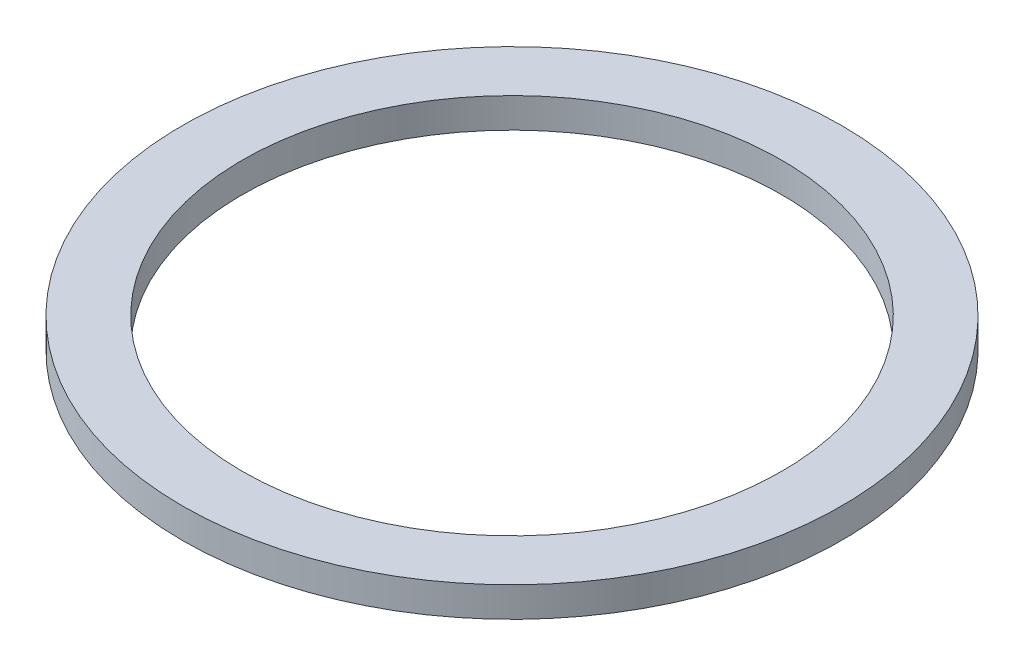
ISO-10303-21;
HEADER;
FILE_DESCRIPTION(('STEP AP214'),'2;1');
FILE_NAME('part.step','',(''),(''),'','','');
FILE_SCHEMA(('AUTOMOTIVE_DESIGN { 1 0 10303 214 1 1 1 1 }'));
ENDSEC;
DATA;
#1=APPLICATION_CONTEXT('core data for automotive mechanical design processes');
#2=APPLICATION_PROTOCOL_DEFINITION('international standard','automotive_design',2000,#1);
#3=PRODUCT_CONTEXT('',#1,'mechanical');
#4=PRODUCT('Part','Part','',(#3));
#5=PRODUCT_RELATED_PRODUCT_CATEGORY('part','',(#4));
#6=PRODUCT_DEFINITION_FORMATION('','',#4);
#7=PRODUCT_DEFINITION_CONTEXT('part definition',#1,'design');
#8=PRODUCT_DEFINITION('design','',#6,#7);
#9=PRODUCT_DEFINITION_SHAPE('','',#8);
#10=(LENGTH_UNIT() NAMED_UNIT(*) SI_UNIT(.MILLI.,.METRE.));
#11=(NAMED_UNIT(*) PLANE_ANGLE_UNIT() SI_UNIT($,.RADIAN.));
#12=(NAMED_UNIT(*) SI_UNIT($,.STERADIAN.) SOLID_ANGLE_UNIT());
#13=UNCERTAINTY_MEASURE_WITH_UNIT(LENGTH_MEASURE(1.E-05),#10,'distance_accuracy_value','');
#14=(GEOMETRIC_REPRESENTATION_CONTEXT(3) GLOBAL_UNCERTAINTY_ASSIGNED_CONTEXT((#13)) GLOBAL_UNIT_ASSIGNED_CONTEXT((#10,
#11,#12)) REPRESENTATION_CONTEXT('',''));
#15=CARTESIAN_POINT('',(0.,0.,0.));
#16=DIRECTION('',(0.,0.,1.));
#17=DIRECTION('',(1.,0.,0.));
#18=AXIS2_PLACEMENT_3D('',#15,#16,#17);
#19=CARTESIAN_POINT('',(0.,5.,0.));
#20=DIRECTION('',(0.,-1.,0.));
#21=DIRECTION('',(0.,0.,-1.));
#22=AXIS2_PLACEMENT_3D('',#19,#20,#21);
#23=CYLINDRICAL_SURFACE('',#22,55.);
#24=CARTESIAN_POINT('',(0.,5.,0.));
#25=DIRECTION('',(0.,1.,0.));
#26=DIRECTION('',(0.,0.,1.));
#27=AXIS2_PLACEMENT_3D('',#24,#25,#26);
#28=CIRCLE('',#27,55.);
#29=CARTESIAN_POINT('',(0.,5.,55.));
#30=VERTEX_POINT('',#29);
#31=EDGE_CURVE('E10',#30,#30,#28,.T.);
#32=ORIENTED_EDGE('',*,*,#31,.F.);
#33=EDGE_LOOP('',(#32));
#34=FACE_BOUND('',#33,.T.);
#35=CARTESIAN_POINT('',(0.,0.,0.));
#36=DIRECTION('',(0.,1.,0.));
#37=DIRECTION('',(0.,0.,1.));
#38=AXIS2_PLACEMENT_3D('',#35,#36,#37);
#39=CIRCLE('',#38,55.);
#40=CARTESIAN_POINT('',(0.,0.,55.));
#41=VERTEX_POINT('',#40);
#42=EDGE_CURVE('E37',#41,#41,#39,.T.);
#43=ORIENTED_EDGE('',*,*,#42,.T.);
#44=EDGE_LOOP('',(#43));
#45=FACE_BOUND('',#44,.T.);
#46=ADVANCED_FACE('F40',(#34,#45),#23,.T.);
#47=CARTESIAN_POINT('',(0.,5.,0.));
#48=DIRECTION('',(0.,1.,0.));
#49=DIRECTION('',(0.,0.,1.));
#50=AXIS2_PLACEMENT_3D('',#47,#48,#49);
#51=PLANE('',#50);
#52=CARTESIAN_POINT('',(0.,5.,0.));
#53=DIRECTION('',(0.,1.,0.));
#54=DIRECTION('',(0.,0.,1.));
#55=AXIS2_PLACEMENT_3D('',#52,#53,#54);
#56=CIRCLE('',#55,45.);
#57=CARTESIAN_POINT('',(0.,5.,45.));
#58=VERTEX_POINT('',#57);
#59=EDGE_CURVE('E50',#58,#58,#56,.T.);
#60=ORIENTED_EDGE('',*,*,#59,.F.);
#61=EDGE_LOOP('',(#60));
#62=FACE_BOUND('',#61,.T.);
#63=ORIENTED_EDGE('',*,*,#31,.T.);
#64=EDGE_LOOP('',(#63));
#65=FACE_BOUND('',#64,.T.);
#66=ADVANCED_FACE('F59',(#62,#65),#51,.T.);
#67=CARTESIAN_POINT('',(0.,0.,0.));
#68=DIRECTION('',(0.,1.,0.));
#69=DIRECTION('',(0.,0.,1.));
#70=AXIS2_PLACEMENT_3D('',#67,#68,#69);
#71=PLANE('',#70);
#72=CARTESIAN_POINT('',(0.,0.,0.));
#73=DIRECTION('',(0.,1.,0.));
#74=DIRECTION('',(0.,0.,1.));
#75=AXIS2_PLACEMENT_3D('',#72,#73,#74);
#76=CIRCLE('',#75,45.);
#77=CARTESIAN_POINT('',(0.,0.,45.));
#78=VERTEX_POINT('',#77);
#79=EDGE_CURVE('E47',#78,#78,#76,.T.);
#80=ORIENTED_EDGE('',*,*,#79,.T.);
#81=EDGE_LOOP('',(#80));
#82=FACE_BOUND('',#81,.T.);
#83=ORIENTED_EDGE('',*,*,#42,.F.);
#84=EDGE_LOOP('',(#83));
#85=FACE_BOUND('',#84,.T.);
#86=ADVANCED_FACE('F58',(#82,#85),#71,.F.);
#87=CARTESIAN_POINT('',(0.,5.,0.));
#88=DIRECTION('',(0.,-1.,0.));
#89=DIRECTION('',(0.,0.,-1.));
#90=AXIS2_PLACEMENT_3D('',#87,#88,#89);
#91=CYLINDRICAL_SURFACE('',#90,45.);
#92=ORIENTED_EDGE('',*,*,#59,.T.);
#93=EDGE_LOOP('',(#92));
#94=FACE_BOUND('',#93,.T.);
#95=ORIENTED_EDGE('',*,*,#79,.F.);
#96=EDGE_LOOP('',(#95));
#97=FACE_BOUND('',#96,.T.);
#98=ADVANCED_FACE('F54',(#94,#97),#91,.F.);
#99=CLOSED_SHELL('',(#46,#66,#86,#98));
#100=MANIFOLD_SOLID_BREP('B2',#99);
#101=ADVANCED_BREP_SHAPE_REPRESENTATION('',(#18,#100),#14);
#102=SHAPE_DEFINITION_REPRESENTATION(#9,#101);
ENDSEC;
END-ISO-10303-21;
